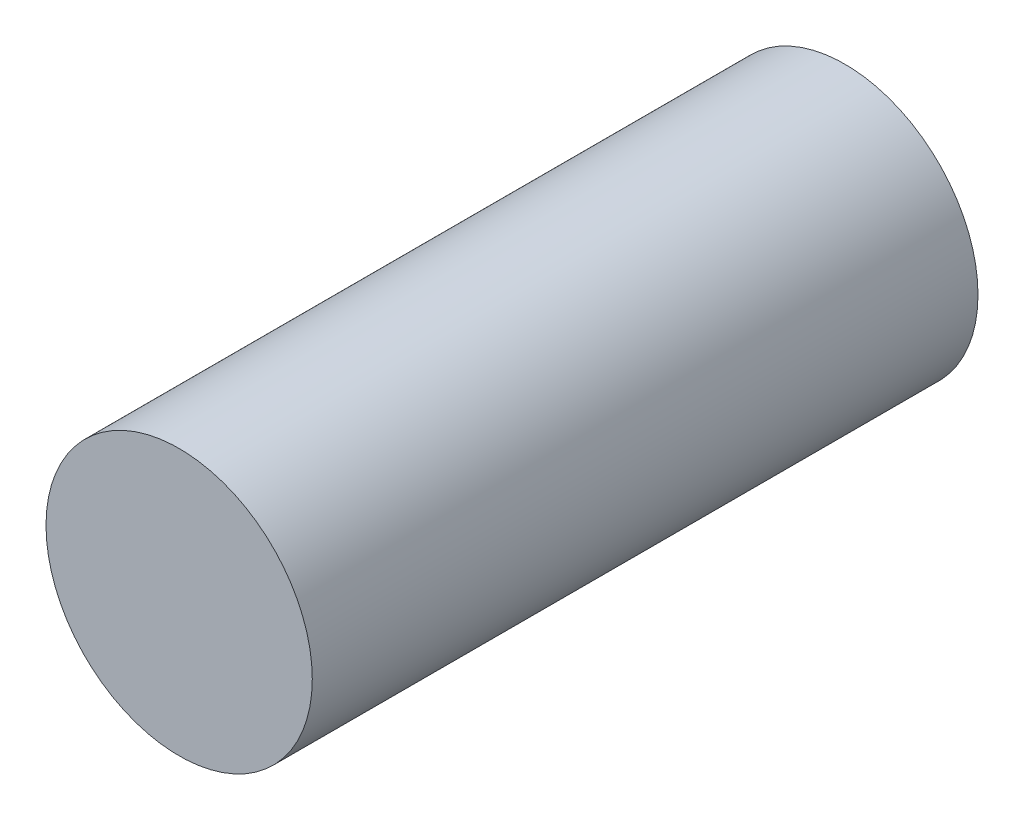
ISO-10303-21;
HEADER;
FILE_DESCRIPTION(('STEP AP214'),'2;1');
FILE_NAME('part.step','',(''),(''),'','','');
FILE_SCHEMA(('AUTOMOTIVE_DESIGN { 1 0 10303 214 1 1 1 1 }'));
ENDSEC;
DATA;
#1=APPLICATION_CONTEXT('core data for automotive mechanical design processes');
#2=APPLICATION_PROTOCOL_DEFINITION('international standard','automotive_design',2000,#1);
#3=PRODUCT_CONTEXT('',#1,'mechanical');
#4=PRODUCT('Part','Part','',(#3));
#5=PRODUCT_RELATED_PRODUCT_CATEGORY('part','',(#4));
#6=PRODUCT_DEFINITION_FORMATION('','',#4);
#7=PRODUCT_DEFINITION_CONTEXT('part definition',#1,'design');
#8=PRODUCT_DEFINITION('design','',#6,#7);
#9=PRODUCT_DEFINITION_SHAPE('','',#8);
#10=(LENGTH_UNIT() NAMED_UNIT(*) SI_UNIT(.MILLI.,.METRE.));
#11=(NAMED_UNIT(*) PLANE_ANGLE_UNIT() SI_UNIT($,.RADIAN.));
#12=(NAMED_UNIT(*) SI_UNIT($,.STERADIAN.) SOLID_ANGLE_UNIT());
#13=UNCERTAINTY_MEASURE_WITH_UNIT(LENGTH_MEASURE(1.E-05),#10,'distance_accuracy_value','');
#14=(GEOMETRIC_REPRESENTATION_CONTEXT(3) GLOBAL_UNCERTAINTY_ASSIGNED_CONTEXT((#13)) GLOBAL_UNIT_ASSIGNED_CONTEXT((#10,
#11,#12)) REPRESENTATION_CONTEXT('',''));
#15=CARTESIAN_POINT('',(0.,0.,0.));
#16=DIRECTION('',(0.,0.,1.));
#17=DIRECTION('',(1.,0.,0.));
#18=AXIS2_PLACEMENT_3D('',#15,#16,#17);
#19=CARTESIAN_POINT('',(0.,0.,25.));
#20=DIRECTION('',(0.,0.,-1.));
#21=DIRECTION('',(-1.,0.,0.));
#22=AXIS2_PLACEMENT_3D('',#19,#20,#21);
#23=CYLINDRICAL_SURFACE('',#22,5.);
#24=CARTESIAN_POINT('',(0.,0.,25.));
#25=DIRECTION('',(0.,0.,1.));
#26=DIRECTION('',(1.,0.,0.));
#27=AXIS2_PLACEMENT_3D('',#24,#25,#26);
#28=CIRCLE('',#27,5.);
#29=CARTESIAN_POINT('',(5.,0.,25.));
#30=VERTEX_POINT('',#29);
#31=EDGE_CURVE('E10',#30,#30,#28,.T.);
#32=ORIENTED_EDGE('',*,*,#31,.F.);
#33=EDGE_LOOP('',(#32));
#34=FACE_BOUND('',#33,.T.);
#35=CARTESIAN_POINT('',(0.,0.,0.));
#36=DIRECTION('',(0.,0.,1.));
#37=DIRECTION('',(1.,0.,0.));
#38=AXIS2_PLACEMENT_3D('',#35,#36,#37);
#39=CIRCLE('',#38,5.);
#40=CARTESIAN_POINT('',(5.,0.,0.));
#41=VERTEX_POINT('',#40);
#42=EDGE_CURVE('E40',#41,#41,#39,.T.);
#43=ORIENTED_EDGE('',*,*,#42,.T.);
#44=EDGE_LOOP('',(#43));
#45=FACE_BOUND('',#44,.T.);
#46=ADVANCED_FACE('F37',(#34,#45),#23,.T.);
#47=CARTESIAN_POINT('',(0.,0.,25.));
#48=DIRECTION('',(0.,0.,1.));
#49=DIRECTION('',(1.,0.,0.));
#50=AXIS2_PLACEMENT_3D('',#47,#48,#49);
#51=PLANE('',#50);
#52=ORIENTED_EDGE('',*,*,#31,.T.);
#53=EDGE_LOOP('',(#52));
#54=FACE_BOUND('',#53,.T.);
#55=ADVANCED_FACE('F54',(#54),#51,.T.);
#56=CARTESIAN_POINT('',(0.,0.,0.));
#57=DIRECTION('',(0.,0.,1.));
#58=DIRECTION('',(1.,0.,0.));
#59=AXIS2_PLACEMENT_3D('',#56,#57,#58);
#60=PLANE('',#59);
#61=ORIENTED_EDGE('',*,*,#42,.F.);
#62=EDGE_LOOP('',(#61));
#63=FACE_BOUND('',#62,.T.);
#64=ADVANCED_FACE('F52',(#63),#60,.F.);
#65=CLOSED_SHELL('',(#46,#55,#64));
#66=MANIFOLD_SOLID_BREP('B2',#65);
#67=ADVANCED_BREP_SHAPE_REPRESENTATION('',(#18,#66),#14);
#68=SHAPE_DEFINITION_REPRESENTATION(#9,#67);
ENDSEC;
END-ISO-10303-21;
